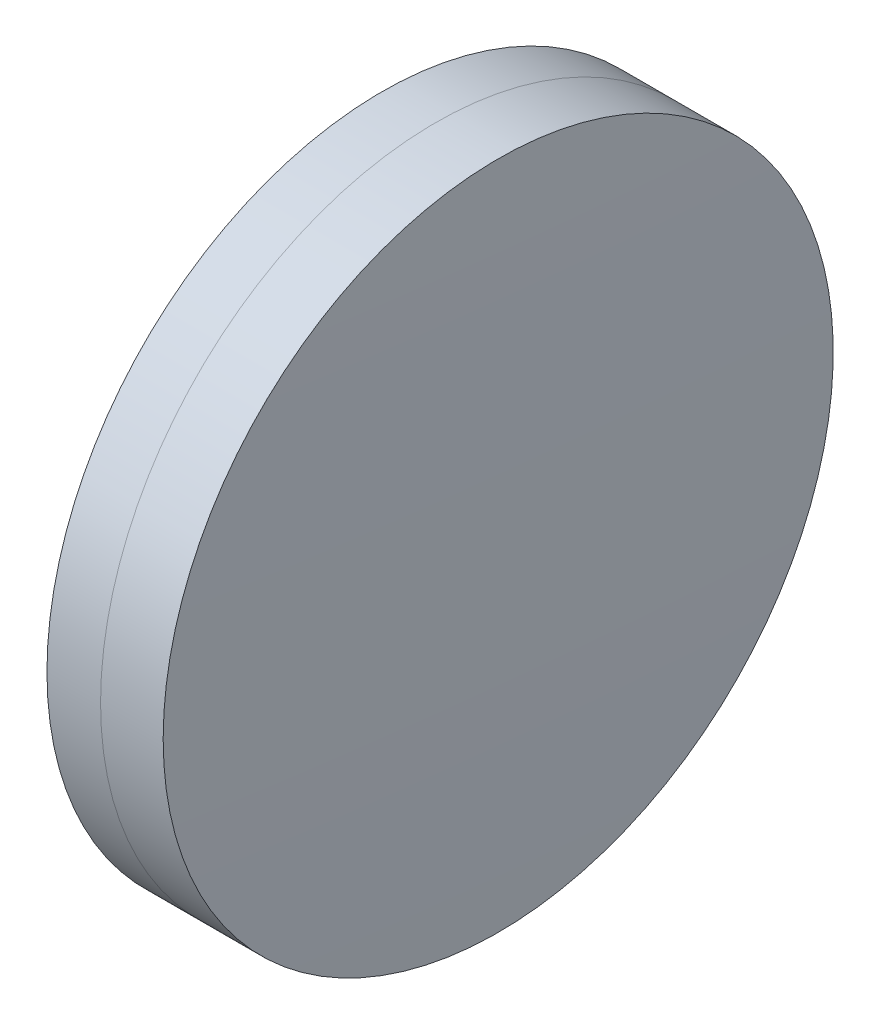
ISO-10303-21;
HEADER;
FILE_DESCRIPTION(('STEP AP214'),'2;1');
FILE_NAME('part.step','',(''),(''),'','','');
FILE_SCHEMA(('AUTOMOTIVE_DESIGN { 1 0 10303 214 1 1 1 1 }'));
ENDSEC;
DATA;
#1=APPLICATION_CONTEXT('core data for automotive mechanical design processes');
#2=APPLICATION_PROTOCOL_DEFINITION('international standard','automotive_design',2000,#1);
#3=PRODUCT_CONTEXT('',#1,'mechanical');
#4=PRODUCT('Part','Part','',(#3));
#5=PRODUCT_RELATED_PRODUCT_CATEGORY('part','',(#4));
#6=PRODUCT_DEFINITION_FORMATION('','',#4);
#7=PRODUCT_DEFINITION_CONTEXT('part definition',#1,'design');
#8=PRODUCT_DEFINITION('design','',#6,#7);
#9=PRODUCT_DEFINITION_SHAPE('','',#8);
#10=(LENGTH_UNIT() NAMED_UNIT(*) SI_UNIT(.MILLI.,.METRE.));
#11=(NAMED_UNIT(*) PLANE_ANGLE_UNIT() SI_UNIT($,.RADIAN.));
#12=(NAMED_UNIT(*) SI_UNIT($,.STERADIAN.) SOLID_ANGLE_UNIT());
#13=UNCERTAINTY_MEASURE_WITH_UNIT(LENGTH_MEASURE(1.E-05),#10,'distance_accuracy_value','');
#14=(GEOMETRIC_REPRESENTATION_CONTEXT(3) GLOBAL_UNCERTAINTY_ASSIGNED_CONTEXT((#13)) GLOBAL_UNIT_ASSIGNED_CONTEXT((#10,
#11,#12)) REPRESENTATION_CONTEXT('',''));
#15=CARTESIAN_POINT('',(0.,0.,0.));
#16=DIRECTION('',(0.,0.,1.));
#17=DIRECTION('',(1.,0.,0.));
#18=AXIS2_PLACEMENT_3D('',#15,#16,#17);
#19=CARTESIAN_POINT('',(14.8796689735747,0.,0.));
#20=DIRECTION('',(-1.,0.,0.));
#21=DIRECTION('',(0.,0.,1.));
#22=AXIS2_PLACEMENT_3D('',#19,#20,#21);
#23=SPHERICAL_SURFACE('',#22,162.39);
#24=CARTESIAN_POINT('',(176.787859316127,0.,0.));
#25=DIRECTION('',(-1.,0.,0.));
#26=DIRECTION('',(0.,0.,1.));
#27=AXIS2_PLACEMENT_3D('',#24,#25,#26);
#28=CIRCLE('',#27,12.5000000000001);
#29=CARTESIAN_POINT('',(176.787859316127,0.,12.5000000000001));
#30=VERTEX_POINT('',#29);
#31=EDGE_CURVE('E11',#30,#30,#28,.T.);
#32=ORIENTED_EDGE('',*,*,#31,.T.);
#33=EDGE_LOOP('',(#32));
#34=FACE_BOUND('',#33,.T.);
#35=ADVANCED_FACE('F45',(#34),#23,.F.);
#36=CARTESIAN_POINT('',(-0.551919992657797,0.,0.));
#37=DIRECTION('',(-1.,0.,0.));
#38=DIRECTION('',(0.,0.,1.));
#39=AXIS2_PLACEMENT_3D('',#36,#37,#38);
#40=CYLINDRICAL_SURFACE('',#39,12.5000000000001);
#41=CARTESIAN_POINT('',(179.123844569151,0.,0.));
#42=DIRECTION('',(-1.,0.,0.));
#43=DIRECTION('',(0.,0.,1.));
#44=AXIS2_PLACEMENT_3D('',#41,#42,#43);
#45=CIRCLE('',#44,12.5);
#46=CARTESIAN_POINT('',(179.123844569151,0.,12.5));
#47=VERTEX_POINT('',#46);
#48=EDGE_CURVE('E51',#47,#47,#45,.T.);
#49=ORIENTED_EDGE('',*,*,#48,.T.);
#50=EDGE_LOOP('',(#49));
#51=FACE_BOUND('',#50,.T.);
#52=ORIENTED_EDGE('',*,*,#31,.F.);
#53=EDGE_LOOP('',(#52));
#54=FACE_BOUND('',#53,.T.);
#55=ADVANCED_FACE('F57',(#51,#54),#40,.T.);
#56=CARTESIAN_POINT('',(-356.550331026425,0.,0.));
#57=DIRECTION('',(-1.,0.,0.));
#58=DIRECTION('',(0.,0.,1.));
#59=AXIS2_PLACEMENT_3D('',#56,#57,#58);
#60=SPHERICAL_SURFACE('',#59,535.82);
#61=ORIENTED_EDGE('',*,*,#48,.F.);
#62=EDGE_LOOP('',(#61));
#63=FACE_BOUND('',#62,.T.);
#64=ADVANCED_FACE('F60',(#63),#60,.T.);
#65=CLOSED_SHELL('',(#35,#55,#64));
#66=MANIFOLD_SOLID_BREP('B2',#65);
#67=CARTESIAN_POINT('',(420.109668973575,0.,0.));
#68=DIRECTION('',(-1.,0.,0.));
#69=DIRECTION('',(0.,0.,1.));
#70=AXIS2_PLACEMENT_3D('',#67,#68,#69);
#71=SPHERICAL_SURFACE('',#70,245.64);
#72=CARTESIAN_POINT('',(174.787921873975,0.,0.));
#73=DIRECTION('',(-1.,0.,0.));
#74=DIRECTION('',(0.,0.,1.));
#75=AXIS2_PLACEMENT_3D('',#72,#73,#74);
#76=CIRCLE('',#75,12.5);
#77=CARTESIAN_POINT('',(174.787921873975,0.,12.5));
#78=VERTEX_POINT('',#77);
#79=EDGE_CURVE('E44',#78,#78,#76,.T.);
#80=ORIENTED_EDGE('',*,*,#79,.T.);
#81=EDGE_LOOP('',(#80));
#82=FACE_BOUND('',#81,.T.);
#83=ADVANCED_FACE('F86',(#82),#71,.T.);
#84=CARTESIAN_POINT('',(-9.70261217833668,0.,0.));
#85=DIRECTION('',(-1.,0.,0.));
#86=DIRECTION('',(0.,0.,1.));
#87=AXIS2_PLACEMENT_3D('',#84,#85,#86);
#88=CYLINDRICAL_SURFACE('',#87,12.5);
#89=CARTESIAN_POINT('',(176.787859316127,0.,0.));
#90=DIRECTION('',(-1.,0.,0.));
#91=DIRECTION('',(0.,0.,1.));
#92=AXIS2_PLACEMENT_3D('',#89,#90,#91);
#93=CIRCLE('',#92,12.5);
#94=CARTESIAN_POINT('',(176.787859316127,0.,12.5));
#95=VERTEX_POINT('',#94);
#96=EDGE_CURVE('E92',#95,#95,#93,.T.);
#97=ORIENTED_EDGE('',*,*,#96,.T.);
#98=EDGE_LOOP('',(#97));
#99=FACE_BOUND('',#98,.T.);
#100=ORIENTED_EDGE('',*,*,#79,.F.);
#101=EDGE_LOOP('',(#100));
#102=FACE_BOUND('',#101,.T.);
#103=ADVANCED_FACE('F98',(#99,#102),#88,.T.);
#104=CARTESIAN_POINT('',(14.8796689735747,0.,0.));
#105=DIRECTION('',(-1.,0.,0.));
#106=DIRECTION('',(0.,0.,1.));
#107=AXIS2_PLACEMENT_3D('',#104,#105,#106);
#108=SPHERICAL_SURFACE('',#107,162.39);
#109=ORIENTED_EDGE('',*,*,#96,.F.);
#110=EDGE_LOOP('',(#109));
#111=FACE_BOUND('',#110,.T.);
#112=ADVANCED_FACE('F101',(#111),#108,.T.);
#113=CLOSED_SHELL('',(#83,#103,#112));
#114=MANIFOLD_SOLID_BREP('B6',#113);
#115=ADVANCED_BREP_SHAPE_REPRESENTATION('',(#18,#66,#114),#14);
#116=SHAPE_DEFINITION_REPRESENTATION(#9,#115);
ENDSEC;
END-ISO-10303-21;
